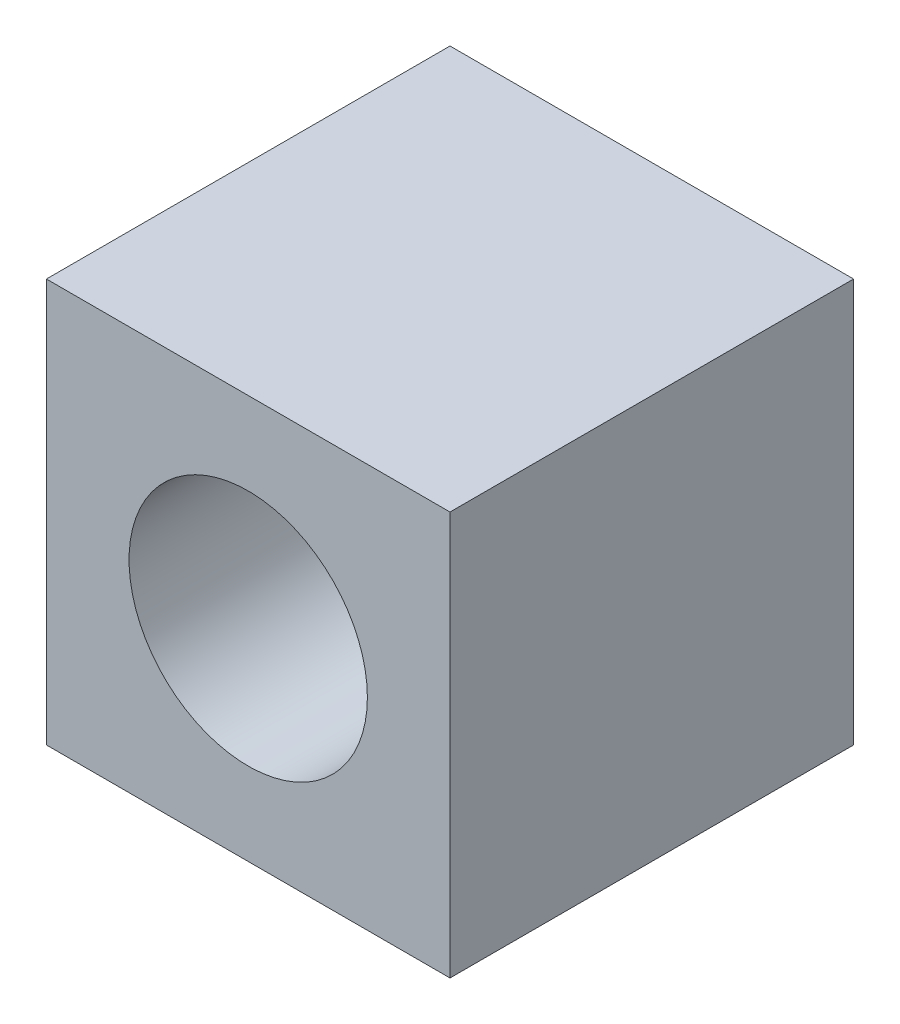
ISO-10303-21;
HEADER;
FILE_DESCRIPTION(('STEP AP214'),'2;1');
FILE_NAME('part.step','',(''),(''),'','','');
FILE_SCHEMA(('AUTOMOTIVE_DESIGN { 1 0 10303 214 1 1 1 1 }'));
ENDSEC;
DATA;
#1=APPLICATION_CONTEXT('core data for automotive mechanical design processes');
#2=APPLICATION_PROTOCOL_DEFINITION('international standard','automotive_design',2000,#1);
#3=PRODUCT_CONTEXT('',#1,'mechanical');
#4=PRODUCT('Part','Part','',(#3));
#5=PRODUCT_RELATED_PRODUCT_CATEGORY('part','',(#4));
#6=PRODUCT_DEFINITION_FORMATION('','',#4);
#7=PRODUCT_DEFINITION_CONTEXT('part definition',#1,'design');
#8=PRODUCT_DEFINITION('design','',#6,#7);
#9=PRODUCT_DEFINITION_SHAPE('','',#8);
#10=(LENGTH_UNIT() NAMED_UNIT(*) SI_UNIT(.MILLI.,.METRE.));
#11=(NAMED_UNIT(*) PLANE_ANGLE_UNIT() SI_UNIT($,.RADIAN.));
#12=(NAMED_UNIT(*) SI_UNIT($,.STERADIAN.) SOLID_ANGLE_UNIT());
#13=UNCERTAINTY_MEASURE_WITH_UNIT(LENGTH_MEASURE(1.E-05),#10,'distance_accuracy_value','');
#14=(GEOMETRIC_REPRESENTATION_CONTEXT(3) GLOBAL_UNCERTAINTY_ASSIGNED_CONTEXT((#13)) GLOBAL_UNIT_ASSIGNED_CONTEXT((#10,
#11,#12)) REPRESENTATION_CONTEXT('',''));
#15=CARTESIAN_POINT('',(0.,0.,0.));
#16=DIRECTION('',(0.,0.,1.));
#17=DIRECTION('',(1.,0.,0.));
#18=AXIS2_PLACEMENT_3D('',#15,#16,#17);
#19=CARTESIAN_POINT('',(25.4,25.4,50.8));
#20=DIRECTION('',(-1.,0.,0.));
#21=DIRECTION('',(0.,-1.,0.));
#22=AXIS2_PLACEMENT_3D('',#19,#20,#21);
#23=PLANE('',#22);
#24=DIRECTION('',(0.,1.,0.));
#25=VECTOR('',#24,1.);
#26=CARTESIAN_POINT('',(25.4,25.4,0.));
#27=LINE('',#26,#25);
#28=CARTESIAN_POINT('',(25.4,-25.4,0.));
#29=VERTEX_POINT('',#28);
#30=CARTESIAN_POINT('',(25.4,25.4,0.));
#31=VERTEX_POINT('',#30);
#32=EDGE_CURVE('E98',#29,#31,#27,.T.);
#33=ORIENTED_EDGE('',*,*,#32,.T.);
#34=DIRECTION('',(0.,0.,-1.));
#35=VECTOR('',#34,1.);
#36=CARTESIAN_POINT('',(25.4,25.4,50.8));
#37=LINE('',#36,#35);
#38=CARTESIAN_POINT('',(25.4,25.4,50.8));
#39=VERTEX_POINT('',#38);
#40=EDGE_CURVE('E11',#39,#31,#37,.T.);
#41=ORIENTED_EDGE('',*,*,#40,.F.);
#42=DIRECTION('',(0.,1.,0.));
#43=VECTOR('',#42,1.);
#44=CARTESIAN_POINT('',(25.4,25.4,50.8));
#45=LINE('',#44,#43);
#46=CARTESIAN_POINT('',(25.4,-25.4,50.8));
#47=VERTEX_POINT('',#46);
#48=EDGE_CURVE('E86',#47,#39,#45,.T.);
#49=ORIENTED_EDGE('',*,*,#48,.F.);
#50=DIRECTION('',(0.,0.,-1.));
#51=VECTOR('',#50,1.);
#52=CARTESIAN_POINT('',(25.4,-25.4,50.8));
#53=LINE('',#52,#51);
#54=EDGE_CURVE('E94',#47,#29,#53,.T.);
#55=ORIENTED_EDGE('',*,*,#54,.T.);
#56=EDGE_LOOP('',(#33,#41,#49,#55));
#57=FACE_BOUND('',#56,.T.);
#58=ADVANCED_FACE('F35',(#57),#23,.F.);
#59=CARTESIAN_POINT('',(-25.4,25.4,50.8));
#60=DIRECTION('',(0.,-1.,0.));
#61=DIRECTION('',(0.,0.,-1.));
#62=AXIS2_PLACEMENT_3D('',#59,#60,#61);
#63=PLANE('',#62);
#64=DIRECTION('',(-1.,0.,0.));
#65=VECTOR('',#64,1.);
#66=CARTESIAN_POINT('',(-25.4,25.4,0.));
#67=LINE('',#66,#65);
#68=CARTESIAN_POINT('',(-25.4,25.4,0.));
#69=VERTEX_POINT('',#68);
#70=EDGE_CURVE('E90',#31,#69,#67,.T.);
#71=ORIENTED_EDGE('',*,*,#70,.T.);
#72=DIRECTION('',(0.,0.,-1.));
#73=VECTOR('',#72,1.);
#74=CARTESIAN_POINT('',(-25.4,25.4,50.8));
#75=LINE('',#74,#73);
#76=CARTESIAN_POINT('',(-25.4,25.4,50.8));
#77=VERTEX_POINT('',#76);
#78=EDGE_CURVE('E43',#77,#69,#75,.T.);
#79=ORIENTED_EDGE('',*,*,#78,.F.);
#80=DIRECTION('',(-1.,0.,0.));
#81=VECTOR('',#80,1.);
#82=CARTESIAN_POINT('',(-25.4,25.4,50.8));
#83=LINE('',#82,#81);
#84=EDGE_CURVE('E81',#39,#77,#83,.T.);
#85=ORIENTED_EDGE('',*,*,#84,.F.);
#86=ORIENTED_EDGE('',*,*,#40,.T.);
#87=EDGE_LOOP('',(#71,#79,#85,#86));
#88=FACE_BOUND('',#87,.T.);
#89=ADVANCED_FACE('F89',(#88),#63,.F.);
#90=CARTESIAN_POINT('',(-25.4,25.4,50.8));
#91=DIRECTION('',(1.,0.,0.));
#92=DIRECTION('',(0.,1.,0.));
#93=AXIS2_PLACEMENT_3D('',#90,#91,#92);
#94=PLANE('',#93);
#95=DIRECTION('',(0.,-1.,0.));
#96=VECTOR('',#95,1.);
#97=CARTESIAN_POINT('',(-25.4,25.4,0.));
#98=LINE('',#97,#96);
#99=CARTESIAN_POINT('',(-25.4,-25.4,0.));
#100=VERTEX_POINT('',#99);
#101=EDGE_CURVE('E68',#69,#100,#98,.T.);
#102=ORIENTED_EDGE('',*,*,#101,.T.);
#103=DIRECTION('',(0.,0.,-1.));
#104=VECTOR('',#103,1.);
#105=CARTESIAN_POINT('',(-25.4,-25.4,50.8));
#106=LINE('',#105,#104);
#107=CARTESIAN_POINT('',(-25.4,-25.4,50.8));
#108=VERTEX_POINT('',#107);
#109=EDGE_CURVE('E91',#108,#100,#106,.T.);
#110=ORIENTED_EDGE('',*,*,#109,.F.);
#111=DIRECTION('',(0.,-1.,0.));
#112=VECTOR('',#111,1.);
#113=CARTESIAN_POINT('',(-25.4,25.4,50.8));
#114=LINE('',#113,#112);
#115=EDGE_CURVE('E84',#77,#108,#114,.T.);
#116=ORIENTED_EDGE('',*,*,#115,.F.);
#117=ORIENTED_EDGE('',*,*,#78,.T.);
#118=EDGE_LOOP('',(#102,#110,#116,#117));
#119=FACE_BOUND('',#118,.T.);
#120=ADVANCED_FACE('F92',(#119),#94,.F.);
#121=CARTESIAN_POINT('',(-25.4,-25.4,50.8));
#122=DIRECTION('',(0.,1.,0.));
#123=DIRECTION('',(0.,0.,1.));
#124=AXIS2_PLACEMENT_3D('',#121,#122,#123);
#125=PLANE('',#124);
#126=DIRECTION('',(1.,0.,0.));
#127=VECTOR('',#126,1.);
#128=CARTESIAN_POINT('',(-25.4,-25.4,0.));
#129=LINE('',#128,#127);
#130=EDGE_CURVE('E74',#100,#29,#129,.T.);
#131=ORIENTED_EDGE('',*,*,#130,.T.);
#132=ORIENTED_EDGE('',*,*,#54,.F.);
#133=DIRECTION('',(1.,0.,0.));
#134=VECTOR('',#133,1.);
#135=CARTESIAN_POINT('',(-25.4,-25.4,50.8));
#136=LINE('',#135,#134);
#137=EDGE_CURVE('E51',#108,#47,#136,.T.);
#138=ORIENTED_EDGE('',*,*,#137,.F.);
#139=ORIENTED_EDGE('',*,*,#109,.T.);
#140=EDGE_LOOP('',(#131,#132,#138,#139));
#141=FACE_BOUND('',#140,.T.);
#142=ADVANCED_FACE('F106',(#141),#125,.F.);
#143=CARTESIAN_POINT('',(0.,0.,50.8));
#144=DIRECTION('',(0.,0.,1.));
#145=DIRECTION('',(1.,0.,0.));
#146=AXIS2_PLACEMENT_3D('',#143,#144,#145);
#147=PLANE('',#146);
#148=CARTESIAN_POINT('',(0.,0.,50.8));
#149=DIRECTION('',(0.,0.,1.));
#150=DIRECTION('',(1.,0.,0.));
#151=AXIS2_PLACEMENT_3D('',#148,#149,#150);
#152=CIRCLE('',#151,15.);
#153=CARTESIAN_POINT('',(15.,0.,50.8));
#154=VERTEX_POINT('',#153);
#155=EDGE_CURVE('E112',#154,#154,#152,.T.);
#156=ORIENTED_EDGE('',*,*,#155,.F.);
#157=EDGE_LOOP('',(#156));
#158=FACE_BOUND('',#157,.T.);
#159=ORIENTED_EDGE('',*,*,#48,.T.);
#160=ORIENTED_EDGE('',*,*,#84,.T.);
#161=ORIENTED_EDGE('',*,*,#115,.T.);
#162=ORIENTED_EDGE('',*,*,#137,.T.);
#163=EDGE_LOOP('',(#159,#160,#161,#162));
#164=FACE_BOUND('',#163,.T.);
#165=ADVANCED_FACE('F82',(#158,#164),#147,.T.);
#166=CARTESIAN_POINT('',(0.,0.,0.));
#167=DIRECTION('',(0.,0.,1.));
#168=DIRECTION('',(1.,0.,0.));
#169=AXIS2_PLACEMENT_3D('',#166,#167,#168);
#170=PLANE('',#169);
#171=CARTESIAN_POINT('',(0.,0.,0.));
#172=DIRECTION('',(0.,0.,1.));
#173=DIRECTION('',(1.,0.,0.));
#174=AXIS2_PLACEMENT_3D('',#171,#172,#173);
#175=CIRCLE('',#174,15.);
#176=CARTESIAN_POINT('',(15.,0.,0.));
#177=VERTEX_POINT('',#176);
#178=EDGE_CURVE('E101',#177,#177,#175,.T.);
#179=ORIENTED_EDGE('',*,*,#178,.T.);
#180=EDGE_LOOP('',(#179));
#181=FACE_BOUND('',#180,.T.);
#182=ORIENTED_EDGE('',*,*,#32,.F.);
#183=ORIENTED_EDGE('',*,*,#130,.F.);
#184=ORIENTED_EDGE('',*,*,#101,.F.);
#185=ORIENTED_EDGE('',*,*,#70,.F.);
#186=EDGE_LOOP('',(#182,#183,#184,#185));
#187=FACE_BOUND('',#186,.T.);
#188=ADVANCED_FACE('F109',(#181,#187),#170,.F.);
#189=CARTESIAN_POINT('',(0.,0.,0.));
#190=DIRECTION('',(0.,0.,1.));
#191=DIRECTION('',(1.,0.,0.));
#192=AXIS2_PLACEMENT_3D('',#189,#190,#191);
#193=CYLINDRICAL_SURFACE('',#192,15.);
#194=ORIENTED_EDGE('',*,*,#178,.F.);
#195=EDGE_LOOP('',(#194));
#196=FACE_BOUND('',#195,.T.);
#197=ORIENTED_EDGE('',*,*,#155,.T.);
#198=EDGE_LOOP('',(#197));
#199=FACE_BOUND('',#198,.T.);
#200=ADVANCED_FACE('F119',(#196,#199),#193,.F.);
#201=CLOSED_SHELL('',(#58,#89,#120,#142,#165,#188,#200));
#202=MANIFOLD_SOLID_BREP('B2',#201);
#203=ADVANCED_BREP_SHAPE_REPRESENTATION('',(#18,#202),#14);
#204=SHAPE_DEFINITION_REPRESENTATION(#9,#203);
ENDSEC;
END-ISO-10303-21;
